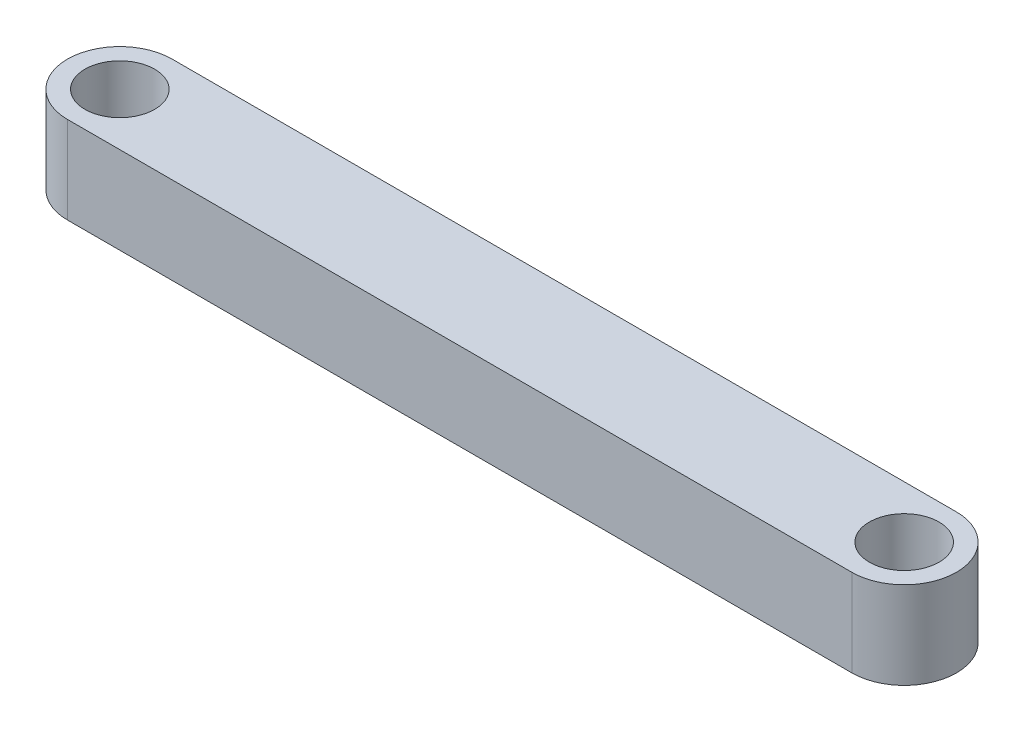
ISO-10303-21;
HEADER;
FILE_DESCRIPTION(('STEP AP214'),'2;1');
FILE_NAME('part.step','',(''),(''),'','','');
FILE_SCHEMA(('AUTOMOTIVE_DESIGN { 1 0 10303 214 1 1 1 1 }'));
ENDSEC;
DATA;
#1=APPLICATION_CONTEXT('core data for automotive mechanical design processes');
#2=APPLICATION_PROTOCOL_DEFINITION('international standard','automotive_design',2000,#1);
#3=PRODUCT_CONTEXT('',#1,'mechanical');
#4=PRODUCT('Part','Part','',(#3));
#5=PRODUCT_RELATED_PRODUCT_CATEGORY('part','',(#4));
#6=PRODUCT_DEFINITION_FORMATION('','',#4);
#7=PRODUCT_DEFINITION_CONTEXT('part definition',#1,'design');
#8=PRODUCT_DEFINITION('design','',#6,#7);
#9=PRODUCT_DEFINITION_SHAPE('','',#8);
#10=(LENGTH_UNIT() NAMED_UNIT(*) SI_UNIT(.MILLI.,.METRE.));
#11=(NAMED_UNIT(*) PLANE_ANGLE_UNIT() SI_UNIT($,.RADIAN.));
#12=(NAMED_UNIT(*) SI_UNIT($,.STERADIAN.) SOLID_ANGLE_UNIT());
#13=UNCERTAINTY_MEASURE_WITH_UNIT(LENGTH_MEASURE(1.E-05),#10,'distance_accuracy_value','');
#14=(GEOMETRIC_REPRESENTATION_CONTEXT(3) GLOBAL_UNCERTAINTY_ASSIGNED_CONTEXT((#13)) GLOBAL_UNIT_ASSIGNED_CONTEXT((#10,
#11,#12)) REPRESENTATION_CONTEXT('',''));
#15=CARTESIAN_POINT('',(0.,0.,0.));
#16=DIRECTION('',(0.,0.,1.));
#17=DIRECTION('',(1.,0.,0.));
#18=AXIS2_PLACEMENT_3D('',#15,#16,#17);
#19=CARTESIAN_POINT('',(-22.5,5.,0.));
#20=DIRECTION('',(0.,1.,0.));
#21=DIRECTION('',(0.,0.,1.));
#22=AXIS2_PLACEMENT_3D('',#19,#20,#21);
#23=PLANE('',#22);
#24=CARTESIAN_POINT('',(-22.5,5.,0.));
#25=DIRECTION('',(0.,1.,0.));
#26=DIRECTION('',(0.,0.,1.));
#27=AXIS2_PLACEMENT_3D('',#24,#25,#26);
#28=CIRCLE('',#27,2.);
#29=CARTESIAN_POINT('',(-22.5,5.,2.));
#30=VERTEX_POINT('',#29);
#31=EDGE_CURVE('E114',#30,#30,#28,.T.);
#32=ORIENTED_EDGE('',*,*,#31,.F.);
#33=EDGE_LOOP('',(#32));
#34=FACE_BOUND('',#33,.T.);
#35=CARTESIAN_POINT('',(-22.5,5.,0.));
#36=DIRECTION('',(0.,1.,0.));
#37=DIRECTION('',(0.,0.,1.));
#38=AXIS2_PLACEMENT_3D('',#35,#36,#37);
#39=CIRCLE('',#38,3.);
#40=CARTESIAN_POINT('',(-22.5,5.,-3.));
#41=VERTEX_POINT('',#40);
#42=CARTESIAN_POINT('',(-22.5,5.,3.));
#43=VERTEX_POINT('',#42);
#44=EDGE_CURVE('E94',#41,#43,#39,.T.);
#45=ORIENTED_EDGE('',*,*,#44,.T.);
#46=DIRECTION('',(1.,0.,0.));
#47=VECTOR('',#46,1.);
#48=CARTESIAN_POINT('',(-22.5,5.,3.));
#49=LINE('',#48,#47);
#50=CARTESIAN_POINT('',(22.5,5.,3.));
#51=VERTEX_POINT('',#50);
#52=EDGE_CURVE('E89',#43,#51,#49,.T.);
#53=ORIENTED_EDGE('',*,*,#52,.T.);
#54=CARTESIAN_POINT('',(22.5,5.,0.));
#55=DIRECTION('',(0.,1.,0.));
#56=DIRECTION('',(0.,0.,1.));
#57=AXIS2_PLACEMENT_3D('',#54,#55,#56);
#58=CIRCLE('',#57,3.);
#59=CARTESIAN_POINT('',(22.5,5.,-3.));
#60=VERTEX_POINT('',#59);
#61=EDGE_CURVE('E92',#51,#60,#58,.T.);
#62=ORIENTED_EDGE('',*,*,#61,.T.);
#63=DIRECTION('',(-1.,0.,0.));
#64=VECTOR('',#63,1.);
#65=CARTESIAN_POINT('',(-22.5,5.,-3.));
#66=LINE('',#65,#64);
#67=EDGE_CURVE('E59',#60,#41,#66,.T.);
#68=ORIENTED_EDGE('',*,*,#67,.T.);
#69=EDGE_LOOP('',(#45,#53,#62,#68));
#70=FACE_BOUND('',#69,.T.);
#71=CARTESIAN_POINT('',(22.5,5.,0.));
#72=DIRECTION('',(0.,1.,0.));
#73=DIRECTION('',(0.,0.,1.));
#74=AXIS2_PLACEMENT_3D('',#71,#72,#73);
#75=CIRCLE('',#74,2.);
#76=CARTESIAN_POINT('',(22.5,5.,2.));
#77=VERTEX_POINT('',#76);
#78=EDGE_CURVE('E136',#77,#77,#75,.T.);
#79=ORIENTED_EDGE('',*,*,#78,.F.);
#80=EDGE_LOOP('',(#79));
#81=FACE_BOUND('',#80,.T.);
#82=ADVANCED_FACE('F41',(#34,#70,#81),#23,.T.);
#83=CARTESIAN_POINT('',(-22.5,0.,0.));
#84=DIRECTION('',(0.,1.,0.));
#85=DIRECTION('',(0.,0.,1.));
#86=AXIS2_PLACEMENT_3D('',#83,#84,#85);
#87=PLANE('',#86);
#88=CARTESIAN_POINT('',(-22.5,0.,0.));
#89=DIRECTION('',(0.,1.,0.));
#90=DIRECTION('',(0.,0.,1.));
#91=AXIS2_PLACEMENT_3D('',#88,#89,#90);
#92=CIRCLE('',#91,3.);
#93=CARTESIAN_POINT('',(-22.5,0.,-3.));
#94=VERTEX_POINT('',#93);
#95=CARTESIAN_POINT('',(-22.5,0.,3.));
#96=VERTEX_POINT('',#95);
#97=EDGE_CURVE('E110',#94,#96,#92,.T.);
#98=ORIENTED_EDGE('',*,*,#97,.F.);
#99=DIRECTION('',(-1.,0.,0.));
#100=VECTOR('',#99,1.);
#101=CARTESIAN_POINT('',(-22.5,0.,-3.));
#102=LINE('',#101,#100);
#103=CARTESIAN_POINT('',(22.5,0.,-3.));
#104=VERTEX_POINT('',#103);
#105=EDGE_CURVE('E82',#104,#94,#102,.T.);
#106=ORIENTED_EDGE('',*,*,#105,.F.);
#107=CARTESIAN_POINT('',(22.5,0.,0.));
#108=DIRECTION('',(0.,1.,0.));
#109=DIRECTION('',(0.,0.,1.));
#110=AXIS2_PLACEMENT_3D('',#107,#108,#109);
#111=CIRCLE('',#110,3.);
#112=CARTESIAN_POINT('',(22.5,0.,3.));
#113=VERTEX_POINT('',#112);
#114=EDGE_CURVE('E76',#113,#104,#111,.T.);
#115=ORIENTED_EDGE('',*,*,#114,.F.);
#116=DIRECTION('',(1.,0.,0.));
#117=VECTOR('',#116,1.);
#118=CARTESIAN_POINT('',(-22.5,0.,3.));
#119=LINE('',#118,#117);
#120=EDGE_CURVE('E99',#96,#113,#119,.T.);
#121=ORIENTED_EDGE('',*,*,#120,.F.);
#122=EDGE_LOOP('',(#98,#106,#115,#121));
#123=FACE_BOUND('',#122,.T.);
#124=CARTESIAN_POINT('',(-22.5,0.,0.));
#125=DIRECTION('',(0.,1.,0.));
#126=DIRECTION('',(0.,0.,1.));
#127=AXIS2_PLACEMENT_3D('',#124,#125,#126);
#128=CIRCLE('',#127,2.);
#129=CARTESIAN_POINT('',(-22.5,0.,2.));
#130=VERTEX_POINT('',#129);
#131=EDGE_CURVE('E132',#130,#130,#128,.T.);
#132=ORIENTED_EDGE('',*,*,#131,.T.);
#133=EDGE_LOOP('',(#132));
#134=FACE_BOUND('',#133,.T.);
#135=CARTESIAN_POINT('',(22.5,0.,0.));
#136=DIRECTION('',(0.,1.,0.));
#137=DIRECTION('',(0.,0.,1.));
#138=AXIS2_PLACEMENT_3D('',#135,#136,#137);
#139=CIRCLE('',#138,2.);
#140=CARTESIAN_POINT('',(22.5,0.,2.));
#141=VERTEX_POINT('',#140);
#142=EDGE_CURVE('E140',#141,#141,#139,.T.);
#143=ORIENTED_EDGE('',*,*,#142,.T.);
#144=EDGE_LOOP('',(#143));
#145=FACE_BOUND('',#144,.T.);
#146=ADVANCED_FACE('F127',(#123,#134,#145),#87,.F.);
#147=CARTESIAN_POINT('',(-22.5,5.,0.));
#148=DIRECTION('',(0.,-1.,0.));
#149=DIRECTION('',(0.,0.,-1.));
#150=AXIS2_PLACEMENT_3D('',#147,#148,#149);
#151=CYLINDRICAL_SURFACE('',#150,3.);
#152=ORIENTED_EDGE('',*,*,#97,.T.);
#153=DIRECTION('',(0.,-1.,0.));
#154=VECTOR('',#153,1.);
#155=CARTESIAN_POINT('',(-22.5,5.,3.));
#156=LINE('',#155,#154);
#157=EDGE_CURVE('E11',#43,#96,#156,.T.);
#158=ORIENTED_EDGE('',*,*,#157,.F.);
#159=ORIENTED_EDGE('',*,*,#44,.F.);
#160=DIRECTION('',(0.,-1.,0.));
#161=VECTOR('',#160,1.);
#162=CARTESIAN_POINT('',(-22.5,5.,-3.));
#163=LINE('',#162,#161);
#164=EDGE_CURVE('E106',#41,#94,#163,.T.);
#165=ORIENTED_EDGE('',*,*,#164,.T.);
#166=EDGE_LOOP('',(#152,#158,#159,#165));
#167=FACE_BOUND('',#166,.T.);
#168=ADVANCED_FACE('F43',(#167),#151,.T.);
#169=CARTESIAN_POINT('',(-22.5,5.,3.));
#170=DIRECTION('',(0.,0.,-1.));
#171=DIRECTION('',(-1.,0.,0.));
#172=AXIS2_PLACEMENT_3D('',#169,#170,#171);
#173=PLANE('',#172);
#174=ORIENTED_EDGE('',*,*,#120,.T.);
#175=DIRECTION('',(0.,-1.,0.));
#176=VECTOR('',#175,1.);
#177=CARTESIAN_POINT('',(22.5,5.,3.));
#178=LINE('',#177,#176);
#179=EDGE_CURVE('E51',#51,#113,#178,.T.);
#180=ORIENTED_EDGE('',*,*,#179,.F.);
#181=ORIENTED_EDGE('',*,*,#52,.F.);
#182=ORIENTED_EDGE('',*,*,#157,.T.);
#183=EDGE_LOOP('',(#174,#180,#181,#182));
#184=FACE_BOUND('',#183,.T.);
#185=ADVANCED_FACE('F98',(#184),#173,.F.);
#186=CARTESIAN_POINT('',(22.5,5.,0.));
#187=DIRECTION('',(0.,-1.,0.));
#188=DIRECTION('',(0.,0.,-1.));
#189=AXIS2_PLACEMENT_3D('',#186,#187,#188);
#190=CYLINDRICAL_SURFACE('',#189,3.);
#191=ORIENTED_EDGE('',*,*,#114,.T.);
#192=DIRECTION('',(0.,-1.,0.));
#193=VECTOR('',#192,1.);
#194=CARTESIAN_POINT('',(22.5,5.,-3.));
#195=LINE('',#194,#193);
#196=EDGE_CURVE('E101',#60,#104,#195,.T.);
#197=ORIENTED_EDGE('',*,*,#196,.F.);
#198=ORIENTED_EDGE('',*,*,#61,.F.);
#199=ORIENTED_EDGE('',*,*,#179,.T.);
#200=EDGE_LOOP('',(#191,#197,#198,#199));
#201=FACE_BOUND('',#200,.T.);
#202=ADVANCED_FACE('F102',(#201),#190,.T.);
#203=CARTESIAN_POINT('',(-22.5,5.,-3.));
#204=DIRECTION('',(0.,0.,1.));
#205=DIRECTION('',(1.,0.,0.));
#206=AXIS2_PLACEMENT_3D('',#203,#204,#205);
#207=PLANE('',#206);
#208=ORIENTED_EDGE('',*,*,#105,.T.);
#209=ORIENTED_EDGE('',*,*,#164,.F.);
#210=ORIENTED_EDGE('',*,*,#67,.F.);
#211=ORIENTED_EDGE('',*,*,#196,.T.);
#212=EDGE_LOOP('',(#208,#209,#210,#211));
#213=FACE_BOUND('',#212,.T.);
#214=ADVANCED_FACE('F124',(#213),#207,.F.);
#215=CARTESIAN_POINT('',(-22.5,5.,0.));
#216=DIRECTION('',(0.,-1.,0.));
#217=DIRECTION('',(0.,0.,-1.));
#218=AXIS2_PLACEMENT_3D('',#215,#216,#217);
#219=CYLINDRICAL_SURFACE('',#218,2.);
#220=ORIENTED_EDGE('',*,*,#31,.T.);
#221=EDGE_LOOP('',(#220));
#222=FACE_BOUND('',#221,.T.);
#223=ORIENTED_EDGE('',*,*,#131,.F.);
#224=EDGE_LOOP('',(#223));
#225=FACE_BOUND('',#224,.T.);
#226=ADVANCED_FACE('F159',(#222,#225),#219,.F.);
#227=CARTESIAN_POINT('',(22.5,5.,0.));
#228=DIRECTION('',(0.,-1.,0.));
#229=DIRECTION('',(0.,0.,-1.));
#230=AXIS2_PLACEMENT_3D('',#227,#228,#229);
#231=CYLINDRICAL_SURFACE('',#230,2.);
#232=ORIENTED_EDGE('',*,*,#78,.T.);
#233=EDGE_LOOP('',(#232));
#234=FACE_BOUND('',#233,.T.);
#235=ORIENTED_EDGE('',*,*,#142,.F.);
#236=EDGE_LOOP('',(#235));
#237=FACE_BOUND('',#236,.T.);
#238=ADVANCED_FACE('F148',(#234,#237),#231,.F.);
#239=CLOSED_SHELL('',(#82,#146,#168,#185,#202,#214,#226,#238));
#240=MANIFOLD_SOLID_BREP('B2',#239);
#241=ADVANCED_BREP_SHAPE_REPRESENTATION('',(#18,#240),#14);
#242=SHAPE_DEFINITION_REPRESENTATION(#9,#241);
ENDSEC;
END-ISO-10303-21;
